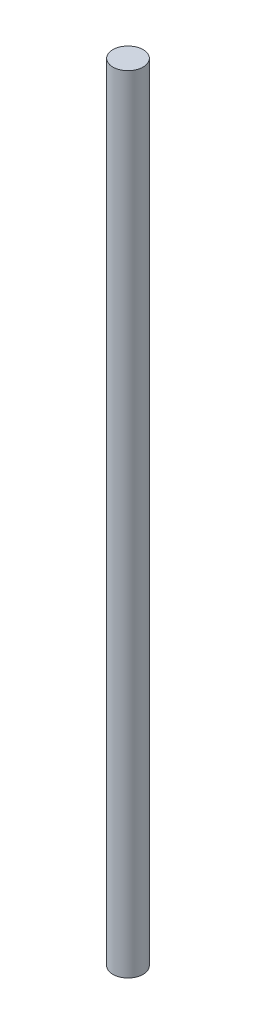
ISO-10303-21;
HEADER;
FILE_DESCRIPTION(('STEP AP214'),'2;1');
FILE_NAME('part.step','',(''),(''),'','','');
FILE_SCHEMA(('AUTOMOTIVE_DESIGN { 1 0 10303 214 1 1 1 1 }'));
ENDSEC;
DATA;
#1=APPLICATION_CONTEXT('core data for automotive mechanical design processes');
#2=APPLICATION_PROTOCOL_DEFINITION('international standard','automotive_design',2000,#1);
#3=PRODUCT_CONTEXT('',#1,'mechanical');
#4=PRODUCT('Part','Part','',(#3));
#5=PRODUCT_RELATED_PRODUCT_CATEGORY('part','',(#4));
#6=PRODUCT_DEFINITION_FORMATION('','',#4);
#7=PRODUCT_DEFINITION_CONTEXT('part definition',#1,'design');
#8=PRODUCT_DEFINITION('design','',#6,#7);
#9=PRODUCT_DEFINITION_SHAPE('','',#8);
#10=(LENGTH_UNIT() NAMED_UNIT(*) SI_UNIT(.MILLI.,.METRE.));
#11=(NAMED_UNIT(*) PLANE_ANGLE_UNIT() SI_UNIT($,.RADIAN.));
#12=(NAMED_UNIT(*) SI_UNIT($,.STERADIAN.) SOLID_ANGLE_UNIT());
#13=UNCERTAINTY_MEASURE_WITH_UNIT(LENGTH_MEASURE(1.E-05),#10,'distance_accuracy_value','');
#14=(GEOMETRIC_REPRESENTATION_CONTEXT(3) GLOBAL_UNCERTAINTY_ASSIGNED_CONTEXT((#13)) GLOBAL_UNIT_ASSIGNED_CONTEXT((#10,
#11,#12)) REPRESENTATION_CONTEXT('',''));
#15=CARTESIAN_POINT('',(0.,0.,0.));
#16=DIRECTION('',(0.,0.,1.));
#17=DIRECTION('',(1.,0.,0.));
#18=AXIS2_PLACEMENT_3D('',#15,#16,#17);
#19=CARTESIAN_POINT('',(0.,260.,0.));
#20=DIRECTION('',(0.,-1.,0.));
#21=DIRECTION('',(0.,0.,-1.));
#22=AXIS2_PLACEMENT_3D('',#19,#20,#21);
#23=CYLINDRICAL_SURFACE('',#22,5.);
#24=CARTESIAN_POINT('',(0.,260.,0.));
#25=DIRECTION('',(0.,1.,0.));
#26=DIRECTION('',(0.,0.,1.));
#27=AXIS2_PLACEMENT_3D('',#24,#25,#26);
#28=CIRCLE('',#27,5.);
#29=CARTESIAN_POINT('',(0.,260.,5.));
#30=VERTEX_POINT('',#29);
#31=EDGE_CURVE('E10',#30,#30,#28,.T.);
#32=ORIENTED_EDGE('',*,*,#31,.F.);
#33=EDGE_LOOP('',(#32));
#34=FACE_BOUND('',#33,.T.);
#35=CARTESIAN_POINT('',(0.,0.,0.));
#36=DIRECTION('',(0.,1.,0.));
#37=DIRECTION('',(0.,0.,1.));
#38=AXIS2_PLACEMENT_3D('',#35,#36,#37);
#39=CIRCLE('',#38,5.);
#40=CARTESIAN_POINT('',(0.,0.,5.));
#41=VERTEX_POINT('',#40);
#42=EDGE_CURVE('E34',#41,#41,#39,.T.);
#43=ORIENTED_EDGE('',*,*,#42,.T.);
#44=EDGE_LOOP('',(#43));
#45=FACE_BOUND('',#44,.T.);
#46=ADVANCED_FACE('F31',(#34,#45),#23,.T.);
#47=CARTESIAN_POINT('',(0.,260.,0.));
#48=DIRECTION('',(0.,1.,0.));
#49=DIRECTION('',(0.,0.,1.));
#50=AXIS2_PLACEMENT_3D('',#47,#48,#49);
#51=PLANE('',#50);
#52=ORIENTED_EDGE('',*,*,#31,.T.);
#53=EDGE_LOOP('',(#52));
#54=FACE_BOUND('',#53,.T.);
#55=ADVANCED_FACE('F46',(#54),#51,.T.);
#56=CARTESIAN_POINT('',(0.,0.,0.));
#57=DIRECTION('',(0.,1.,0.));
#58=DIRECTION('',(0.,0.,1.));
#59=AXIS2_PLACEMENT_3D('',#56,#57,#58);
#60=PLANE('',#59);
#61=ORIENTED_EDGE('',*,*,#42,.F.);
#62=EDGE_LOOP('',(#61));
#63=FACE_BOUND('',#62,.T.);
#64=ADVANCED_FACE('F44',(#63),#60,.F.);
#65=CLOSED_SHELL('',(#46,#55,#64));
#66=MANIFOLD_SOLID_BREP('B2',#65);
#67=ADVANCED_BREP_SHAPE_REPRESENTATION('',(#18,#66),#14);
#68=SHAPE_DEFINITION_REPRESENTATION(#9,#67);
ENDSEC;
END-ISO-10303-21;
